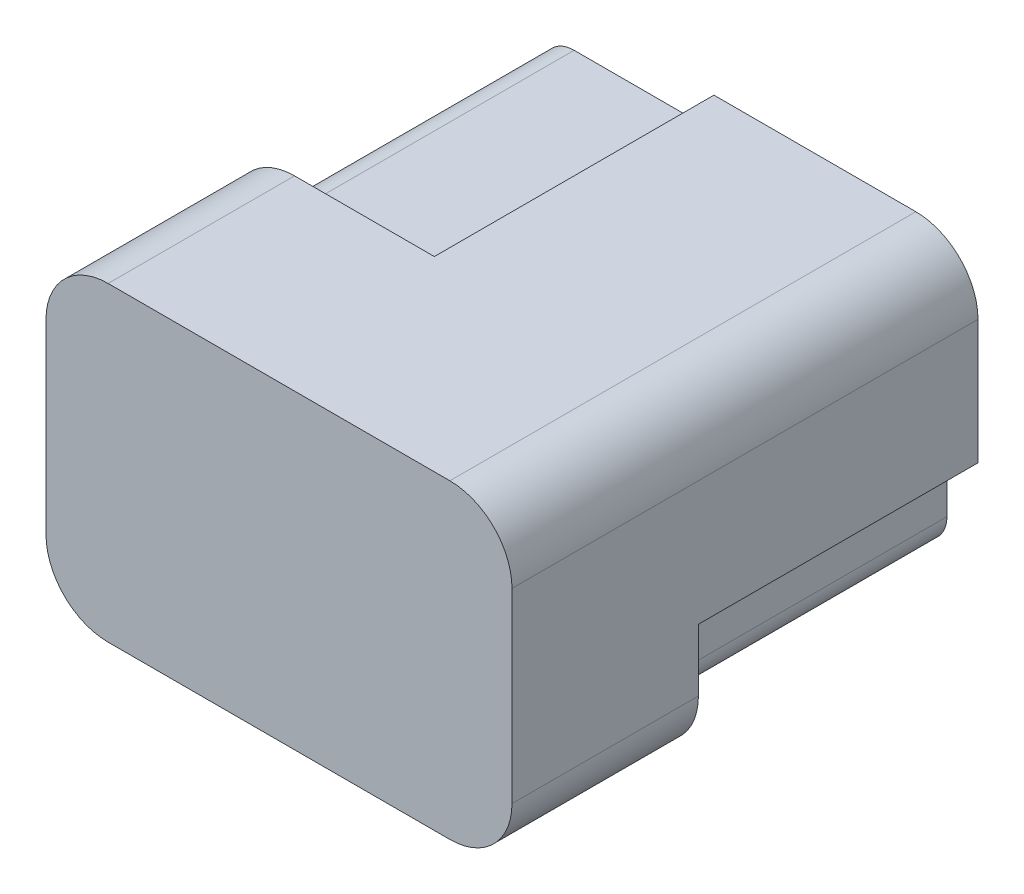
ISO-10303-21;
HEADER;
FILE_DESCRIPTION(('STEP AP214'),'2;1');
FILE_NAME('part.step','',(''),(''),'','','');
FILE_SCHEMA(('AUTOMOTIVE_DESIGN { 1 0 10303 214 1 1 1 1 }'));
ENDSEC;
DATA;
#1=APPLICATION_CONTEXT('core data for automotive mechanical design processes');
#2=APPLICATION_PROTOCOL_DEFINITION('international standard','automotive_design',2000,#1);
#3=PRODUCT_CONTEXT('',#1,'mechanical');
#4=PRODUCT('Part','Part','',(#3));
#5=PRODUCT_RELATED_PRODUCT_CATEGORY('part','',(#4));
#6=PRODUCT_DEFINITION_FORMATION('','',#4);
#7=PRODUCT_DEFINITION_CONTEXT('part definition',#1,'design');
#8=PRODUCT_DEFINITION('design','',#6,#7);
#9=PRODUCT_DEFINITION_SHAPE('','',#8);
#10=(LENGTH_UNIT() NAMED_UNIT(*) SI_UNIT(.MILLI.,.METRE.));
#11=(NAMED_UNIT(*) PLANE_ANGLE_UNIT() SI_UNIT($,.RADIAN.));
#12=(NAMED_UNIT(*) SI_UNIT($,.STERADIAN.) SOLID_ANGLE_UNIT());
#13=UNCERTAINTY_MEASURE_WITH_UNIT(LENGTH_MEASURE(1.E-05),#10,'distance_accuracy_value','');
#14=(GEOMETRIC_REPRESENTATION_CONTEXT(3) GLOBAL_UNCERTAINTY_ASSIGNED_CONTEXT((#13)) GLOBAL_UNIT_ASSIGNED_CONTEXT((#10,
#11,#12)) REPRESENTATION_CONTEXT('',''));
#15=CARTESIAN_POINT('',(0.,0.,0.));
#16=DIRECTION('',(0.,0.,1.));
#17=DIRECTION('',(1.,0.,0.));
#18=AXIS2_PLACEMENT_3D('',#15,#16,#17);
#19=CARTESIAN_POINT('',(-5.49999999999998,5.,15.));
#20=DIRECTION('',(0.,-1.,0.));
#21=DIRECTION('',(0.,0.,-1.));
#22=AXIS2_PLACEMENT_3D('',#19,#20,#21);
#23=PLANE('',#22);
#24=DIRECTION('',(0.,0.,-1.));
#25=VECTOR('',#24,1.);
#26=CARTESIAN_POINT('',(-0.999999999999999,5.,8.));
#27=LINE('',#26,#25);
#28=CARTESIAN_POINT('',(-0.999999999999999,5.,9.));
#29=VERTEX_POINT('',#28);
#30=CARTESIAN_POINT('',(-0.999999999999999,5.,0.));
#31=VERTEX_POINT('',#30);
#32=EDGE_CURVE('E201',#29,#31,#27,.T.);
#33=ORIENTED_EDGE('',*,*,#32,.F.);
#34=DIRECTION('',(1.,0.,0.));
#35=VECTOR('',#34,1.);
#36=CARTESIAN_POINT('',(-5.49999999999999,5.,9.));
#37=LINE('',#36,#35);
#38=CARTESIAN_POINT('',(-5.49999999999999,5.,9.));
#39=VERTEX_POINT('',#38);
#40=EDGE_CURVE('E37',#39,#29,#37,.T.);
#41=ORIENTED_EDGE('',*,*,#40,.F.);
#42=DIRECTION('',(0.,0.,-1.));
#43=VECTOR('',#42,1.);
#44=CARTESIAN_POINT('',(-5.49999999999998,5.,15.));
#45=LINE('',#44,#43);
#46=CARTESIAN_POINT('',(-5.49999999999998,5.,15.));
#47=VERTEX_POINT('',#46);
#48=EDGE_CURVE('E198',#47,#39,#45,.T.);
#49=ORIENTED_EDGE('',*,*,#48,.F.);
#50=DIRECTION('',(-1.,0.,0.));
#51=VECTOR('',#50,1.);
#52=CARTESIAN_POINT('',(-5.49999999999998,5.,15.));
#53=LINE('',#52,#51);
#54=CARTESIAN_POINT('',(5.5,5.,15.));
#55=VERTEX_POINT('',#54);
#56=EDGE_CURVE('E316',#55,#47,#53,.T.);
#57=ORIENTED_EDGE('',*,*,#56,.F.);
#58=DIRECTION('',(0.,0.,-1.));
#59=VECTOR('',#58,1.);
#60=CARTESIAN_POINT('',(5.5,5.,15.));
#61=LINE('',#60,#59);
#62=CARTESIAN_POINT('',(5.5,5.,0.));
#63=VERTEX_POINT('',#62);
#64=EDGE_CURVE('E204',#55,#63,#61,.T.);
#65=ORIENTED_EDGE('',*,*,#64,.T.);
#66=DIRECTION('',(-1.,0.,0.));
#67=VECTOR('',#66,1.);
#68=CARTESIAN_POINT('',(-5.49999999999998,5.,0.));
#69=LINE('',#68,#67);
#70=EDGE_CURVE('E329',#63,#31,#69,.T.);
#71=ORIENTED_EDGE('',*,*,#70,.T.);
#72=EDGE_LOOP('',(#33,#41,#49,#57,#65,#71));
#73=FACE_BOUND('',#72,.T.);
#74=ADVANCED_FACE('F33',(#73),#23,.F.);
#75=CARTESIAN_POINT('',(5.50000000000001,-3.,15.));
#76=DIRECTION('',(0.,0.,-1.));
#77=DIRECTION('',(-1.,0.,0.));
#78=AXIS2_PLACEMENT_3D('',#75,#76,#77);
#79=CYLINDRICAL_SURFACE('',#78,2.);
#80=DIRECTION('',(0.,0.,-1.));
#81=VECTOR('',#80,1.);
#82=CARTESIAN_POINT('',(5.5,-5.,15.));
#83=LINE('',#82,#81);
#84=CARTESIAN_POINT('',(5.5,-5.,15.));
#85=VERTEX_POINT('',#84);
#86=CARTESIAN_POINT('',(5.5,-5.,9.));
#87=VERTEX_POINT('',#86);
#88=EDGE_CURVE('E325',#85,#87,#83,.T.);
#89=ORIENTED_EDGE('',*,*,#88,.T.);
#90=CARTESIAN_POINT('',(5.50000000000001,-3.,9.));
#91=DIRECTION('',(0.,0.,-1.));
#92=DIRECTION('',(-1.,0.,0.));
#93=AXIS2_PLACEMENT_3D('',#90,#91,#92);
#94=CIRCLE('',#93,2.);
#95=CARTESIAN_POINT('',(7.50000000000001,-2.99999999999998,9.));
#96=VERTEX_POINT('',#95);
#97=EDGE_CURVE('E230',#87,#96,#94,.F.);
#98=ORIENTED_EDGE('',*,*,#97,.T.);
#99=DIRECTION('',(0.,0.,-1.));
#100=VECTOR('',#99,1.);
#101=CARTESIAN_POINT('',(7.50000000000001,-2.99999999999998,15.));
#102=LINE('',#101,#100);
#103=CARTESIAN_POINT('',(7.50000000000001,-2.99999999999998,15.));
#104=VERTEX_POINT('',#103);
#105=EDGE_CURVE('E224',#104,#96,#102,.T.);
#106=ORIENTED_EDGE('',*,*,#105,.F.);
#107=CARTESIAN_POINT('',(5.50000000000001,-3.,15.));
#108=DIRECTION('',(0.,0.,1.));
#109=DIRECTION('',(1.,0.,0.));
#110=AXIS2_PLACEMENT_3D('',#107,#108,#109);
#111=CIRCLE('',#110,2.);
#112=EDGE_CURVE('E308',#85,#104,#111,.T.);
#113=ORIENTED_EDGE('',*,*,#112,.F.);
#114=EDGE_LOOP('',(#89,#98,#106,#113));
#115=FACE_BOUND('',#114,.T.);
#116=ADVANCED_FACE('F391',(#115),#79,.T.);
#117=CARTESIAN_POINT('',(-5.49999999999999,3.,15.));
#118=DIRECTION('',(0.,0.,-1.));
#119=DIRECTION('',(-1.,0.,0.));
#120=AXIS2_PLACEMENT_3D('',#117,#118,#119);
#121=CYLINDRICAL_SURFACE('',#120,2.);
#122=ORIENTED_EDGE('',*,*,#48,.T.);
#123=CARTESIAN_POINT('',(-5.49999999999999,3.,9.));
#124=DIRECTION('',(0.,0.,1.));
#125=DIRECTION('',(1.,0.,0.));
#126=AXIS2_PLACEMENT_3D('',#123,#124,#125);
#127=CIRCLE('',#126,2.);
#128=CARTESIAN_POINT('',(-7.49999999999999,3.,9.));
#129=VERTEX_POINT('',#128);
#130=EDGE_CURVE('E172',#39,#129,#127,.T.);
#131=ORIENTED_EDGE('',*,*,#130,.T.);
#132=DIRECTION('',(0.,0.,-1.));
#133=VECTOR('',#132,1.);
#134=CARTESIAN_POINT('',(-7.49999999999999,2.99999999999999,15.));
#135=LINE('',#134,#133);
#136=CARTESIAN_POINT('',(-7.49999999999999,2.99999999999999,15.));
#137=VERTEX_POINT('',#136);
#138=EDGE_CURVE('E205',#137,#129,#135,.T.);
#139=ORIENTED_EDGE('',*,*,#138,.F.);
#140=CARTESIAN_POINT('',(-5.49999999999999,3.,15.));
#141=DIRECTION('',(0.,0.,1.));
#142=DIRECTION('',(-1.,0.,0.));
#143=AXIS2_PLACEMENT_3D('',#140,#141,#142);
#144=CIRCLE('',#143,2.);
#145=EDGE_CURVE('E203',#47,#137,#144,.T.);
#146=ORIENTED_EDGE('',*,*,#145,.F.);
#147=EDGE_LOOP('',(#122,#131,#139,#146));
#148=FACE_BOUND('',#147,.T.);
#149=ADVANCED_FACE('F202',(#148),#121,.T.);
#150=CARTESIAN_POINT('',(7.50000000000001,-2.99999999999998,15.));
#151=DIRECTION('',(-1.,0.,0.));
#152=DIRECTION('',(0.,0.,1.));
#153=AXIS2_PLACEMENT_3D('',#150,#151,#152);
#154=PLANE('',#153);
#155=ORIENTED_EDGE('',*,*,#105,.T.);
#156=DIRECTION('',(0.,1.,0.));
#157=VECTOR('',#156,1.);
#158=CARTESIAN_POINT('',(7.50000000000001,-1.,9.));
#159=LINE('',#158,#157);
#160=CARTESIAN_POINT('',(7.50000000000001,-1.,9.));
#161=VERTEX_POINT('',#160);
#162=EDGE_CURVE('E227',#96,#161,#159,.T.);
#163=ORIENTED_EDGE('',*,*,#162,.T.);
#164=DIRECTION('',(0.,0.,-1.));
#165=VECTOR('',#164,1.);
#166=CARTESIAN_POINT('',(7.50000000000001,-1.,8.));
#167=LINE('',#166,#165);
#168=CARTESIAN_POINT('',(7.50000000000001,-1.,0.));
#169=VERTEX_POINT('',#168);
#170=EDGE_CURVE('E269',#161,#169,#167,.T.);
#171=ORIENTED_EDGE('',*,*,#170,.T.);
#172=DIRECTION('',(0.,1.,0.));
#173=VECTOR('',#172,1.);
#174=CARTESIAN_POINT('',(7.50000000000001,-2.99999999999998,0.));
#175=LINE('',#174,#173);
#176=CARTESIAN_POINT('',(7.50000000000001,2.99999999999999,0.));
#177=VERTEX_POINT('',#176);
#178=EDGE_CURVE('E298',#169,#177,#175,.T.);
#179=ORIENTED_EDGE('',*,*,#178,.T.);
#180=DIRECTION('',(0.,0.,-1.));
#181=VECTOR('',#180,1.);
#182=CARTESIAN_POINT('',(7.50000000000001,2.99999999999999,15.));
#183=LINE('',#182,#181);
#184=CARTESIAN_POINT('',(7.50000000000001,2.99999999999999,15.));
#185=VERTEX_POINT('',#184);
#186=EDGE_CURVE('E208',#185,#177,#183,.T.);
#187=ORIENTED_EDGE('',*,*,#186,.F.);
#188=DIRECTION('',(0.,1.,0.));
#189=VECTOR('',#188,1.);
#190=CARTESIAN_POINT('',(7.50000000000001,-2.99999999999998,15.));
#191=LINE('',#190,#189);
#192=EDGE_CURVE('E311',#104,#185,#191,.T.);
#193=ORIENTED_EDGE('',*,*,#192,.F.);
#194=EDGE_LOOP('',(#155,#163,#171,#179,#187,#193));
#195=FACE_BOUND('',#194,.T.);
#196=ADVANCED_FACE('F387',(#195),#154,.F.);
#197=CARTESIAN_POINT('',(5.50000000000001,3.,15.));
#198=DIRECTION('',(0.,0.,-1.));
#199=DIRECTION('',(-1.,0.,0.));
#200=AXIS2_PLACEMENT_3D('',#197,#198,#199);
#201=CYLINDRICAL_SURFACE('',#200,2.);
#202=CARTESIAN_POINT('',(5.50000000000001,3.,0.));
#203=DIRECTION('',(0.,0.,1.));
#204=DIRECTION('',(-1.,0.,0.));
#205=AXIS2_PLACEMENT_3D('',#202,#203,#204);
#206=CIRCLE('',#205,2.);
#207=EDGE_CURVE('E327',#177,#63,#206,.T.);
#208=ORIENTED_EDGE('',*,*,#207,.T.);
#209=ORIENTED_EDGE('',*,*,#64,.F.);
#210=CARTESIAN_POINT('',(5.50000000000001,3.,15.));
#211=DIRECTION('',(0.,0.,1.));
#212=DIRECTION('',(-1.,0.,0.));
#213=AXIS2_PLACEMENT_3D('',#210,#211,#212);
#214=CIRCLE('',#213,2.);
#215=EDGE_CURVE('E314',#185,#55,#214,.T.);
#216=ORIENTED_EDGE('',*,*,#215,.F.);
#217=ORIENTED_EDGE('',*,*,#186,.T.);
#218=EDGE_LOOP('',(#208,#209,#216,#217));
#219=FACE_BOUND('',#218,.T.);
#220=ADVANCED_FACE('F455',(#219),#201,.T.);
#221=CARTESIAN_POINT('',(-7.49999999999999,-2.99999999999998,15.));
#222=DIRECTION('',(1.,0.,0.));
#223=DIRECTION('',(0.,0.,-1.));
#224=AXIS2_PLACEMENT_3D('',#221,#222,#223);
#225=PLANE('',#224);
#226=DIRECTION('',(0.,-1.,0.));
#227=VECTOR('',#226,1.);
#228=CARTESIAN_POINT('',(-7.49999999999999,3.,9.));
#229=LINE('',#228,#227);
#230=CARTESIAN_POINT('',(-7.49999999999999,2.,9.));
#231=VERTEX_POINT('',#230);
#232=EDGE_CURVE('E216',#129,#231,#229,.T.);
#233=ORIENTED_EDGE('',*,*,#232,.T.);
#234=DIRECTION('',(0.,0.,-1.));
#235=VECTOR('',#234,1.);
#236=CARTESIAN_POINT('',(-7.49999999999999,2.,8.));
#237=LINE('',#236,#235);
#238=CARTESIAN_POINT('',(-7.49999999999999,2.,0.));
#239=VERTEX_POINT('',#238);
#240=EDGE_CURVE('E295',#231,#239,#237,.T.);
#241=ORIENTED_EDGE('',*,*,#240,.T.);
#242=DIRECTION('',(0.,-1.,0.));
#243=VECTOR('',#242,1.);
#244=CARTESIAN_POINT('',(-7.49999999999999,-2.99999999999998,0.));
#245=LINE('',#244,#243);
#246=CARTESIAN_POINT('',(-7.49999999999999,-2.99999999999998,0.));
#247=VERTEX_POINT('',#246);
#248=EDGE_CURVE('E331',#239,#247,#245,.T.);
#249=ORIENTED_EDGE('',*,*,#248,.T.);
#250=DIRECTION('',(0.,0.,-1.));
#251=VECTOR('',#250,1.);
#252=CARTESIAN_POINT('',(-7.49999999999999,-2.99999999999998,15.));
#253=LINE('',#252,#251);
#254=CARTESIAN_POINT('',(-7.49999999999999,-2.99999999999998,15.));
#255=VERTEX_POINT('',#254);
#256=EDGE_CURVE('E210',#255,#247,#253,.T.);
#257=ORIENTED_EDGE('',*,*,#256,.F.);
#258=DIRECTION('',(0.,-1.,0.));
#259=VECTOR('',#258,1.);
#260=CARTESIAN_POINT('',(-7.49999999999999,-2.99999999999998,15.));
#261=LINE('',#260,#259);
#262=EDGE_CURVE('E319',#137,#255,#261,.T.);
#263=ORIENTED_EDGE('',*,*,#262,.F.);
#264=ORIENTED_EDGE('',*,*,#138,.T.);
#265=EDGE_LOOP('',(#233,#241,#249,#257,#263,#264));
#266=FACE_BOUND('',#265,.T.);
#267=ADVANCED_FACE('F362',(#266),#225,.F.);
#268=CARTESIAN_POINT('',(-5.49999999999999,-3.,15.));
#269=DIRECTION('',(0.,0.,-1.));
#270=DIRECTION('',(-1.,0.,0.));
#271=AXIS2_PLACEMENT_3D('',#268,#269,#270);
#272=CYLINDRICAL_SURFACE('',#271,2.);
#273=CARTESIAN_POINT('',(-5.49999999999999,-3.,0.));
#274=DIRECTION('',(0.,0.,1.));
#275=DIRECTION('',(-1.,0.,0.));
#276=AXIS2_PLACEMENT_3D('',#273,#274,#275);
#277=CIRCLE('',#276,2.);
#278=CARTESIAN_POINT('',(-5.49999999999998,-5.,0.));
#279=VERTEX_POINT('',#278);
#280=EDGE_CURVE('E333',#247,#279,#277,.T.);
#281=ORIENTED_EDGE('',*,*,#280,.T.);
#282=DIRECTION('',(0.,0.,-1.));
#283=VECTOR('',#282,1.);
#284=CARTESIAN_POINT('',(-5.49999999999998,-5.,15.));
#285=LINE('',#284,#283);
#286=CARTESIAN_POINT('',(-5.49999999999998,-5.,15.));
#287=VERTEX_POINT('',#286);
#288=EDGE_CURVE('E337',#287,#279,#285,.T.);
#289=ORIENTED_EDGE('',*,*,#288,.F.);
#290=CARTESIAN_POINT('',(-5.49999999999999,-3.,15.));
#291=DIRECTION('',(0.,0.,1.));
#292=DIRECTION('',(-1.,0.,0.));
#293=AXIS2_PLACEMENT_3D('',#290,#291,#292);
#294=CIRCLE('',#293,2.);
#295=EDGE_CURVE('E321',#255,#287,#294,.T.);
#296=ORIENTED_EDGE('',*,*,#295,.F.);
#297=ORIENTED_EDGE('',*,*,#256,.T.);
#298=EDGE_LOOP('',(#281,#289,#296,#297));
#299=FACE_BOUND('',#298,.T.);
#300=ADVANCED_FACE('F344',(#299),#272,.T.);
#301=CARTESIAN_POINT('',(-5.49999999999998,-5.,15.));
#302=DIRECTION('',(0.,1.,0.));
#303=DIRECTION('',(0.,0.,1.));
#304=AXIS2_PLACEMENT_3D('',#301,#302,#303);
#305=PLANE('',#304);
#306=DIRECTION('',(0.,0.,-1.));
#307=VECTOR('',#306,1.);
#308=CARTESIAN_POINT('',(0.999999999999999,-5.,8.));
#309=LINE('',#308,#307);
#310=CARTESIAN_POINT('',(0.999999999999999,-5.,9.));
#311=VERTEX_POINT('',#310);
#312=CARTESIAN_POINT('',(0.999999999999999,-5.,0.));
#313=VERTEX_POINT('',#312);
#314=EDGE_CURVE('E51',#311,#313,#309,.T.);
#315=ORIENTED_EDGE('',*,*,#314,.F.);
#316=DIRECTION('',(1.,0.,0.));
#317=VECTOR('',#316,1.);
#318=CARTESIAN_POINT('',(5.5,-5.,9.));
#319=LINE('',#318,#317);
#320=EDGE_CURVE('E55',#311,#87,#319,.T.);
#321=ORIENTED_EDGE('',*,*,#320,.T.);
#322=ORIENTED_EDGE('',*,*,#88,.F.);
#323=DIRECTION('',(1.,0.,0.));
#324=VECTOR('',#323,1.);
#325=CARTESIAN_POINT('',(-5.49999999999998,-5.,15.));
#326=LINE('',#325,#324);
#327=EDGE_CURVE('E323',#287,#85,#326,.T.);
#328=ORIENTED_EDGE('',*,*,#327,.F.);
#329=ORIENTED_EDGE('',*,*,#288,.T.);
#330=DIRECTION('',(1.,0.,0.));
#331=VECTOR('',#330,1.);
#332=CARTESIAN_POINT('',(-5.49999999999998,-5.,0.));
#333=LINE('',#332,#331);
#334=EDGE_CURVE('E312',#279,#313,#333,.T.);
#335=ORIENTED_EDGE('',*,*,#334,.T.);
#336=EDGE_LOOP('',(#315,#321,#322,#328,#329,#335));
#337=FACE_BOUND('',#336,.T.);
#338=ADVANCED_FACE('F355',(#337),#305,.F.);
#339=CARTESIAN_POINT('',(5.50000000000001,-3.,15.));
#340=DIRECTION('',(0.,0.,1.));
#341=DIRECTION('',(1.,0.,0.));
#342=AXIS2_PLACEMENT_3D('',#339,#340,#341);
#343=PLANE('',#342);
#344=ORIENTED_EDGE('',*,*,#112,.T.);
#345=ORIENTED_EDGE('',*,*,#192,.T.);
#346=ORIENTED_EDGE('',*,*,#215,.T.);
#347=ORIENTED_EDGE('',*,*,#56,.T.);
#348=ORIENTED_EDGE('',*,*,#145,.T.);
#349=ORIENTED_EDGE('',*,*,#262,.T.);
#350=ORIENTED_EDGE('',*,*,#295,.T.);
#351=ORIENTED_EDGE('',*,*,#327,.T.);
#352=EDGE_LOOP('',(#344,#345,#346,#347,#348,#349,#350,#351));
#353=FACE_BOUND('',#352,.T.);
#354=ADVANCED_FACE('F359',(#353),#343,.T.);
#355=CARTESIAN_POINT('',(5.50000000000001,-3.,0.));
#356=DIRECTION('',(0.,0.,1.));
#357=DIRECTION('',(1.,0.,0.));
#358=AXIS2_PLACEMENT_3D('',#355,#356,#357);
#359=PLANE('',#358);
#360=DIRECTION('',(1.,0.,0.));
#361=VECTOR('',#360,1.);
#362=CARTESIAN_POINT('',(5.50000000000001,-4.,0.));
#363=LINE('',#362,#361);
#364=CARTESIAN_POINT('',(1.,-4.,0.));
#365=VERTEX_POINT('',#364);
#366=CARTESIAN_POINT('',(5.50000000000001,-4.,0.));
#367=VERTEX_POINT('',#366);
#368=EDGE_CURVE('E259',#365,#367,#363,.T.);
#369=ORIENTED_EDGE('',*,*,#368,.F.);
#370=DIRECTION('',(0.,1.,0.));
#371=VECTOR('',#370,1.);
#372=CARTESIAN_POINT('',(1.,-4.,0.));
#373=LINE('',#372,#371);
#374=EDGE_CURVE('E256',#313,#365,#373,.T.);
#375=ORIENTED_EDGE('',*,*,#374,.F.);
#376=ORIENTED_EDGE('',*,*,#334,.F.);
#377=ORIENTED_EDGE('',*,*,#280,.F.);
#378=ORIENTED_EDGE('',*,*,#248,.F.);
#379=DIRECTION('',(-1.,0.,0.));
#380=VECTOR('',#379,1.);
#381=CARTESIAN_POINT('',(-6.49999999999999,2.,0.));
#382=LINE('',#381,#380);
#383=CARTESIAN_POINT('',(-6.49999999999999,2.,0.));
#384=VERTEX_POINT('',#383);
#385=EDGE_CURVE('E278',#384,#239,#382,.T.);
#386=ORIENTED_EDGE('',*,*,#385,.F.);
#387=DIRECTION('',(0.,-1.,0.));
#388=VECTOR('',#387,1.);
#389=CARTESIAN_POINT('',(-6.49999999999999,3.,0.));
#390=LINE('',#389,#388);
#391=CARTESIAN_POINT('',(-6.49999999999999,3.,0.));
#392=VERTEX_POINT('',#391);
#393=EDGE_CURVE('E291',#392,#384,#390,.T.);
#394=ORIENTED_EDGE('',*,*,#393,.F.);
#395=CARTESIAN_POINT('',(-5.49999999999999,3.,0.));
#396=DIRECTION('',(0.,0.,1.));
#397=DIRECTION('',(1.,0.,0.));
#398=AXIS2_PLACEMENT_3D('',#395,#396,#397);
#399=CIRCLE('',#398,1.);
#400=CARTESIAN_POINT('',(-5.49999999999999,4.,0.));
#401=VERTEX_POINT('',#400);
#402=EDGE_CURVE('E288',#401,#392,#399,.T.);
#403=ORIENTED_EDGE('',*,*,#402,.F.);
#404=DIRECTION('',(-1.,0.,0.));
#405=VECTOR('',#404,1.);
#406=CARTESIAN_POINT('',(-1.,4.,0.));
#407=LINE('',#406,#405);
#408=CARTESIAN_POINT('',(-1.,4.,0.));
#409=VERTEX_POINT('',#408);
#410=EDGE_CURVE('E285',#409,#401,#407,.T.);
#411=ORIENTED_EDGE('',*,*,#410,.F.);
#412=DIRECTION('',(0.,-1.,0.));
#413=VECTOR('',#412,1.);
#414=CARTESIAN_POINT('',(-0.999999999999999,5.,0.));
#415=LINE('',#414,#413);
#416=EDGE_CURVE('E265',#31,#409,#415,.T.);
#417=ORIENTED_EDGE('',*,*,#416,.F.);
#418=ORIENTED_EDGE('',*,*,#70,.F.);
#419=ORIENTED_EDGE('',*,*,#207,.F.);
#420=ORIENTED_EDGE('',*,*,#178,.F.);
#421=DIRECTION('',(1.,0.,0.));
#422=VECTOR('',#421,1.);
#423=CARTESIAN_POINT('',(7.50000000000001,-1.,0.));
#424=LINE('',#423,#422);
#425=CARTESIAN_POINT('',(6.50000000000001,-1.,0.));
#426=VERTEX_POINT('',#425);
#427=EDGE_CURVE('E249',#426,#169,#424,.T.);
#428=ORIENTED_EDGE('',*,*,#427,.F.);
#429=DIRECTION('',(0.,1.,0.));
#430=VECTOR('',#429,1.);
#431=CARTESIAN_POINT('',(6.50000000000001,-1.,0.));
#432=LINE('',#431,#430);
#433=CARTESIAN_POINT('',(6.50000000000001,-3.,0.));
#434=VERTEX_POINT('',#433);
#435=EDGE_CURVE('E242',#434,#426,#432,.T.);
#436=ORIENTED_EDGE('',*,*,#435,.F.);
#437=CARTESIAN_POINT('',(5.50000000000001,-3.,0.));
#438=DIRECTION('',(0.,0.,1.));
#439=DIRECTION('',(-1.,0.,0.));
#440=AXIS2_PLACEMENT_3D('',#437,#438,#439);
#441=CIRCLE('',#440,1.);
#442=EDGE_CURVE('E237',#367,#434,#441,.T.);
#443=ORIENTED_EDGE('',*,*,#442,.F.);
#444=EDGE_LOOP('',(#369,#375,#376,#377,#378,#386,#394,#403,#411,#417,#418,#419,#420,#428,#436,#443));
#445=FACE_BOUND('',#444,.T.);
#446=ADVANCED_FACE('F352',(#445),#359,.F.);
#447=CARTESIAN_POINT('',(-6.49999999999999,2.,8.));
#448=DIRECTION('',(0.,-1.,0.));
#449=DIRECTION('',(0.,0.,-1.));
#450=AXIS2_PLACEMENT_3D('',#447,#448,#449);
#451=PLANE('',#450);
#452=ORIENTED_EDGE('',*,*,#385,.T.);
#453=ORIENTED_EDGE('',*,*,#240,.F.);
#454=DIRECTION('',(-0.707106781186547,0.,0.707106781186548));
#455=VECTOR('',#454,1.);
#456=CARTESIAN_POINT('',(-7.49999999999999,2.,9.));
#457=LINE('',#456,#455);
#458=CARTESIAN_POINT('',(-6.49999999999999,2.,8.));
#459=VERTEX_POINT('',#458);
#460=EDGE_CURVE('E183',#459,#231,#457,.T.);
#461=ORIENTED_EDGE('',*,*,#460,.F.);
#462=DIRECTION('',(0.,0.,-1.));
#463=VECTOR('',#462,1.);
#464=CARTESIAN_POINT('',(-6.49999999999999,2.,8.));
#465=LINE('',#464,#463);
#466=EDGE_CURVE('E299',#459,#384,#465,.T.);
#467=ORIENTED_EDGE('',*,*,#466,.T.);
#468=EDGE_LOOP('',(#452,#453,#461,#467));
#469=FACE_BOUND('',#468,.T.);
#470=ADVANCED_FACE('F427',(#469),#451,.F.);
#471=CARTESIAN_POINT('',(-6.49999999999999,3.,8.));
#472=DIRECTION('',(1.,0.,0.));
#473=DIRECTION('',(0.,1.,0.));
#474=AXIS2_PLACEMENT_3D('',#471,#472,#473);
#475=PLANE('',#474);
#476=ORIENTED_EDGE('',*,*,#393,.T.);
#477=ORIENTED_EDGE('',*,*,#466,.F.);
#478=DIRECTION('',(0.,-1.,0.));
#479=VECTOR('',#478,1.);
#480=CARTESIAN_POINT('',(-6.49999999999999,3.,8.));
#481=LINE('',#480,#479);
#482=CARTESIAN_POINT('',(-6.49999999999999,3.,8.));
#483=VERTEX_POINT('',#482);
#484=EDGE_CURVE('E280',#483,#459,#481,.T.);
#485=ORIENTED_EDGE('',*,*,#484,.F.);
#486=DIRECTION('',(0.,0.,-1.));
#487=VECTOR('',#486,1.);
#488=CARTESIAN_POINT('',(-6.49999999999999,3.,8.));
#489=LINE('',#488,#487);
#490=EDGE_CURVE('E301',#483,#392,#489,.T.);
#491=ORIENTED_EDGE('',*,*,#490,.T.);
#492=EDGE_LOOP('',(#476,#477,#485,#491));
#493=FACE_BOUND('',#492,.T.);
#494=ADVANCED_FACE('F430',(#493),#475,.F.);
#495=CARTESIAN_POINT('',(-5.49999999999999,3.,8.));
#496=DIRECTION('',(0.,0.,-1.));
#497=DIRECTION('',(-1.,0.,0.));
#498=AXIS2_PLACEMENT_3D('',#495,#496,#497);
#499=CYLINDRICAL_SURFACE('',#498,1.);
#500=ORIENTED_EDGE('',*,*,#402,.T.);
#501=ORIENTED_EDGE('',*,*,#490,.F.);
#502=CARTESIAN_POINT('',(-5.49999999999999,3.,8.));
#503=DIRECTION('',(0.,0.,1.));
#504=DIRECTION('',(1.,0.,0.));
#505=AXIS2_PLACEMENT_3D('',#502,#503,#504);
#506=CIRCLE('',#505,1.);
#507=CARTESIAN_POINT('',(-5.49999999999999,4.,8.));
#508=VERTEX_POINT('',#507);
#509=EDGE_CURVE('E277',#508,#483,#506,.T.);
#510=ORIENTED_EDGE('',*,*,#509,.F.);
#511=DIRECTION('',(0.,0.,-1.));
#512=VECTOR('',#511,1.);
#513=CARTESIAN_POINT('',(-5.49999999999999,4.,8.));
#514=LINE('',#513,#512);
#515=EDGE_CURVE('E303',#508,#401,#514,.T.);
#516=ORIENTED_EDGE('',*,*,#515,.T.);
#517=EDGE_LOOP('',(#500,#501,#510,#516));
#518=FACE_BOUND('',#517,.T.);
#519=ADVANCED_FACE('F434',(#518),#499,.T.);
#520=CARTESIAN_POINT('',(-1.,4.,8.));
#521=DIRECTION('',(0.,-1.,0.));
#522=DIRECTION('',(0.,0.,-1.));
#523=AXIS2_PLACEMENT_3D('',#520,#521,#522);
#524=PLANE('',#523);
#525=ORIENTED_EDGE('',*,*,#410,.T.);
#526=ORIENTED_EDGE('',*,*,#515,.F.);
#527=DIRECTION('',(-1.,0.,0.));
#528=VECTOR('',#527,1.);
#529=CARTESIAN_POINT('',(-1.,4.,8.));
#530=LINE('',#529,#528);
#531=CARTESIAN_POINT('',(-1.,4.,8.));
#532=VERTEX_POINT('',#531);
#533=EDGE_CURVE('E191',#532,#508,#530,.T.);
#534=ORIENTED_EDGE('',*,*,#533,.F.);
#535=DIRECTION('',(0.,0.,-1.));
#536=VECTOR('',#535,1.);
#537=CARTESIAN_POINT('',(-1.,4.,8.));
#538=LINE('',#537,#536);
#539=EDGE_CURVE('E305',#532,#409,#538,.T.);
#540=ORIENTED_EDGE('',*,*,#539,.T.);
#541=EDGE_LOOP('',(#525,#526,#534,#540));
#542=FACE_BOUND('',#541,.T.);
#543=ADVANCED_FACE('F438',(#542),#524,.F.);
#544=CARTESIAN_POINT('',(-0.999999999999999,5.,8.));
#545=DIRECTION('',(1.,0.,0.));
#546=DIRECTION('',(0.,1.,0.));
#547=AXIS2_PLACEMENT_3D('',#544,#545,#546);
#548=PLANE('',#547);
#549=ORIENTED_EDGE('',*,*,#416,.T.);
#550=ORIENTED_EDGE('',*,*,#539,.F.);
#551=DIRECTION('',(0.,0.707106781186547,0.707106781186548));
#552=VECTOR('',#551,1.);
#553=CARTESIAN_POINT('',(-0.999999999999999,5.,9.));
#554=LINE('',#553,#552);
#555=EDGE_CURVE('E193',#532,#29,#554,.T.);
#556=ORIENTED_EDGE('',*,*,#555,.T.);
#557=ORIENTED_EDGE('',*,*,#32,.T.);
#558=EDGE_LOOP('',(#549,#550,#556,#557));
#559=FACE_BOUND('',#558,.T.);
#560=ADVANCED_FACE('F426',(#559),#548,.F.);
#561=CARTESIAN_POINT('',(5.50000000000001,-3.,8.));
#562=DIRECTION('',(0.,0.,-1.));
#563=DIRECTION('',(-1.,0.,0.));
#564=AXIS2_PLACEMENT_3D('',#561,#562,#563);
#565=CYLINDRICAL_SURFACE('',#564,1.);
#566=ORIENTED_EDGE('',*,*,#442,.T.);
#567=DIRECTION('',(0.,0.,-1.));
#568=VECTOR('',#567,1.);
#569=CARTESIAN_POINT('',(6.50000000000001,-3.,8.));
#570=LINE('',#569,#568);
#571=CARTESIAN_POINT('',(6.50000000000001,-3.,8.));
#572=VERTEX_POINT('',#571);
#573=EDGE_CURVE('E274',#572,#434,#570,.T.);
#574=ORIENTED_EDGE('',*,*,#573,.F.);
#575=CARTESIAN_POINT('',(5.50000000000001,-3.,8.));
#576=DIRECTION('',(0.,0.,1.));
#577=DIRECTION('',(-1.,0.,0.));
#578=AXIS2_PLACEMENT_3D('',#575,#576,#577);
#579=CIRCLE('',#578,1.);
#580=CARTESIAN_POINT('',(5.50000000000001,-4.,8.));
#581=VERTEX_POINT('',#580);
#582=EDGE_CURVE('E262',#581,#572,#579,.T.);
#583=ORIENTED_EDGE('',*,*,#582,.F.);
#584=DIRECTION('',(0.,0.,-1.));
#585=VECTOR('',#584,1.);
#586=CARTESIAN_POINT('',(5.50000000000001,-4.,8.));
#587=LINE('',#586,#585);
#588=EDGE_CURVE('E263',#581,#367,#587,.T.);
#589=ORIENTED_EDGE('',*,*,#588,.T.);
#590=EDGE_LOOP('',(#566,#574,#583,#589));
#591=FACE_BOUND('',#590,.T.);
#592=ADVANCED_FACE('F381',(#591),#565,.T.);
#593=CARTESIAN_POINT('',(5.50000000000001,-4.,8.));
#594=DIRECTION('',(0.,1.,0.));
#595=DIRECTION('',(0.,0.,1.));
#596=AXIS2_PLACEMENT_3D('',#593,#594,#595);
#597=PLANE('',#596);
#598=ORIENTED_EDGE('',*,*,#368,.T.);
#599=ORIENTED_EDGE('',*,*,#588,.F.);
#600=DIRECTION('',(1.,0.,0.));
#601=VECTOR('',#600,1.);
#602=CARTESIAN_POINT('',(5.50000000000001,-4.,8.));
#603=LINE('',#602,#601);
#604=CARTESIAN_POINT('',(1.,-4.,8.));
#605=VERTEX_POINT('',#604);
#606=EDGE_CURVE('E252',#605,#581,#603,.T.);
#607=ORIENTED_EDGE('',*,*,#606,.F.);
#608=DIRECTION('',(0.,0.,-1.));
#609=VECTOR('',#608,1.);
#610=CARTESIAN_POINT('',(1.,-4.,8.));
#611=LINE('',#610,#609);
#612=EDGE_CURVE('E266',#605,#365,#611,.T.);
#613=ORIENTED_EDGE('',*,*,#612,.T.);
#614=EDGE_LOOP('',(#598,#599,#607,#613));
#615=FACE_BOUND('',#614,.T.);
#616=ADVANCED_FACE('F379',(#615),#597,.F.);
#617=CARTESIAN_POINT('',(1.,-4.,8.));
#618=DIRECTION('',(-1.,0.,0.));
#619=DIRECTION('',(0.,-1.,0.));
#620=AXIS2_PLACEMENT_3D('',#617,#618,#619);
#621=PLANE('',#620);
#622=ORIENTED_EDGE('',*,*,#374,.T.);
#623=ORIENTED_EDGE('',*,*,#612,.F.);
#624=DIRECTION('',(0.,-0.707106781186546,0.707106781186549));
#625=VECTOR('',#624,1.);
#626=CARTESIAN_POINT('',(1.,-4.,8.));
#627=LINE('',#626,#625);
#628=EDGE_CURVE('E11',#605,#311,#627,.T.);
#629=ORIENTED_EDGE('',*,*,#628,.T.);
#630=ORIENTED_EDGE('',*,*,#314,.T.);
#631=EDGE_LOOP('',(#622,#623,#629,#630));
#632=FACE_BOUND('',#631,.T.);
#633=ADVANCED_FACE('F419',(#632),#621,.F.);
#634=CARTESIAN_POINT('',(7.50000000000001,-1.,8.));
#635=DIRECTION('',(0.,1.,0.));
#636=DIRECTION('',(-1.,0.,0.));
#637=AXIS2_PLACEMENT_3D('',#634,#635,#636);
#638=PLANE('',#637);
#639=ORIENTED_EDGE('',*,*,#427,.T.);
#640=ORIENTED_EDGE('',*,*,#170,.F.);
#641=DIRECTION('',(-0.707106781186546,0.,-0.707106781186549));
#642=VECTOR('',#641,1.);
#643=CARTESIAN_POINT('',(7.00000000000001,-1.,8.5));
#644=LINE('',#643,#642);
#645=CARTESIAN_POINT('',(6.50000000000001,-1.,8.));
#646=VERTEX_POINT('',#645);
#647=EDGE_CURVE('E43',#161,#646,#644,.T.);
#648=ORIENTED_EDGE('',*,*,#647,.T.);
#649=DIRECTION('',(0.,0.,-1.));
#650=VECTOR('',#649,1.);
#651=CARTESIAN_POINT('',(6.50000000000001,-1.,8.));
#652=LINE('',#651,#650);
#653=EDGE_CURVE('E272',#646,#426,#652,.T.);
#654=ORIENTED_EDGE('',*,*,#653,.T.);
#655=EDGE_LOOP('',(#639,#640,#648,#654));
#656=FACE_BOUND('',#655,.T.);
#657=ADVANCED_FACE('F413',(#656),#638,.F.);
#658=CARTESIAN_POINT('',(6.50000000000001,-1.,8.));
#659=DIRECTION('',(-1.,0.,0.));
#660=DIRECTION('',(0.,-1.,0.));
#661=AXIS2_PLACEMENT_3D('',#658,#659,#660);
#662=PLANE('',#661);
#663=ORIENTED_EDGE('',*,*,#435,.T.);
#664=ORIENTED_EDGE('',*,*,#653,.F.);
#665=DIRECTION('',(0.,1.,0.));
#666=VECTOR('',#665,1.);
#667=CARTESIAN_POINT('',(6.50000000000001,-1.,8.));
#668=LINE('',#667,#666);
#669=EDGE_CURVE('E369',#572,#646,#668,.T.);
#670=ORIENTED_EDGE('',*,*,#669,.F.);
#671=ORIENTED_EDGE('',*,*,#573,.T.);
#672=EDGE_LOOP('',(#663,#664,#670,#671));
#673=FACE_BOUND('',#672,.T.);
#674=ADVANCED_FACE('F409',(#673),#662,.F.);
#675=CARTESIAN_POINT('',(5.50000000000001,-4.,8.));
#676=DIRECTION('',(0.,-0.707106781186549,-0.707106781186546));
#677=DIRECTION('',(1.,0.,0.));
#678=AXIS2_PLACEMENT_3D('',#675,#676,#677);
#679=PLANE('',#678);
#680=ORIENTED_EDGE('',*,*,#628,.F.);
#681=ORIENTED_EDGE('',*,*,#606,.T.);
#682=DIRECTION('',(0.,0.707106781186546,-0.707106781186549));
#683=VECTOR('',#682,1.);
#684=CARTESIAN_POINT('',(5.5,-5.,9.));
#685=LINE('',#684,#683);
#686=EDGE_CURVE('E235',#87,#581,#685,.T.);
#687=ORIENTED_EDGE('',*,*,#686,.F.);
#688=ORIENTED_EDGE('',*,*,#320,.F.);
#689=EDGE_LOOP('',(#680,#681,#687,#688));
#690=FACE_BOUND('',#689,.T.);
#691=ADVANCED_FACE('F35',(#690),#679,.T.);
#692=CARTESIAN_POINT('',(5.50000000000001,-3.,8.));
#693=DIRECTION('',(0.,0.,1.));
#694=DIRECTION('',(1.,0.,0.));
#695=AXIS2_PLACEMENT_3D('',#692,#693,#694);
#696=CONICAL_SURFACE('',#695,1.,0.785398163397447);
#697=ORIENTED_EDGE('',*,*,#686,.T.);
#698=ORIENTED_EDGE('',*,*,#582,.T.);
#699=DIRECTION('',(-0.707106781186546,0.,-0.707106781186549));
#700=VECTOR('',#699,1.);
#701=CARTESIAN_POINT('',(7.50000000000001,-2.99999999999998,9.));
#702=LINE('',#701,#700);
#703=EDGE_CURVE('E234',#96,#572,#702,.T.);
#704=ORIENTED_EDGE('',*,*,#703,.F.);
#705=ORIENTED_EDGE('',*,*,#97,.F.);
#706=EDGE_LOOP('',(#697,#698,#704,#705));
#707=FACE_BOUND('',#706,.T.);
#708=ADVANCED_FACE('F383',(#707),#696,.T.);
#709=CARTESIAN_POINT('',(6.50000000000001,-3.,8.));
#710=DIRECTION('',(0.707106781186549,0.,-0.707106781186546));
#711=DIRECTION('',(0.,1.,0.));
#712=AXIS2_PLACEMENT_3D('',#709,#710,#711);
#713=PLANE('',#712);
#714=ORIENTED_EDGE('',*,*,#647,.F.);
#715=ORIENTED_EDGE('',*,*,#162,.F.);
#716=ORIENTED_EDGE('',*,*,#703,.T.);
#717=ORIENTED_EDGE('',*,*,#669,.T.);
#718=EDGE_LOOP('',(#714,#715,#716,#717));
#719=FACE_BOUND('',#718,.T.);
#720=ADVANCED_FACE('F385',(#719),#713,.T.);
#721=CARTESIAN_POINT('',(-7.49999999999999,3.,9.));
#722=DIRECTION('',(0.707106781186548,0.,0.707106781186547));
#723=DIRECTION('',(0.707106781186547,0.,-0.707106781186548));
#724=AXIS2_PLACEMENT_3D('',#721,#722,#723);
#725=PLANE('',#724);
#726=DIRECTION('',(-0.707106781186547,0.,0.707106781186548));
#727=VECTOR('',#726,1.);
#728=CARTESIAN_POINT('',(-7.49999999999999,3.,9.));
#729=LINE('',#728,#727);
#730=EDGE_CURVE('E178',#483,#129,#729,.T.);
#731=ORIENTED_EDGE('',*,*,#730,.F.);
#732=ORIENTED_EDGE('',*,*,#484,.T.);
#733=ORIENTED_EDGE('',*,*,#460,.T.);
#734=ORIENTED_EDGE('',*,*,#232,.F.);
#735=EDGE_LOOP('',(#731,#732,#733,#734));
#736=FACE_BOUND('',#735,.T.);
#737=ADVANCED_FACE('F404',(#736),#725,.F.);
#738=CARTESIAN_POINT('',(-5.49999999999999,3.,8.));
#739=DIRECTION('',(0.,0.,1.));
#740=DIRECTION('',(1.,0.,0.));
#741=AXIS2_PLACEMENT_3D('',#738,#739,#740);
#742=CONICAL_SURFACE('',#741,1.,0.785398163397448);
#743=DIRECTION('',(0.,0.707106781186547,0.707106781186548));
#744=VECTOR('',#743,1.);
#745=CARTESIAN_POINT('',(-5.49999999999999,5.,9.));
#746=LINE('',#745,#744);
#747=EDGE_CURVE('E176',#508,#39,#746,.T.);
#748=ORIENTED_EDGE('',*,*,#747,.F.);
#749=ORIENTED_EDGE('',*,*,#509,.T.);
#750=ORIENTED_EDGE('',*,*,#730,.T.);
#751=ORIENTED_EDGE('',*,*,#130,.F.);
#752=EDGE_LOOP('',(#748,#749,#750,#751));
#753=FACE_BOUND('',#752,.T.);
#754=ADVANCED_FACE('F174',(#753),#742,.T.);
#755=CARTESIAN_POINT('',(-5.49999999999999,5.,9.));
#756=DIRECTION('',(0.,0.707106781186548,-0.707106781186547));
#757=DIRECTION('',(0.,0.707106781186547,0.707106781186548));
#758=AXIS2_PLACEMENT_3D('',#755,#756,#757);
#759=PLANE('',#758);
#760=ORIENTED_EDGE('',*,*,#555,.F.);
#761=ORIENTED_EDGE('',*,*,#533,.T.);
#762=ORIENTED_EDGE('',*,*,#747,.T.);
#763=ORIENTED_EDGE('',*,*,#40,.T.);
#764=EDGE_LOOP('',(#760,#761,#762,#763));
#765=FACE_BOUND('',#764,.T.);
#766=ADVANCED_FACE('F188',(#765),#759,.T.);
#767=CLOSED_SHELL('',(#74,#116,#149,#196,#220,#267,#300,#338,#354,#446,#470,#494,#519,#543,#560,
#592,#616,#633,#657,#674,#691,#708,#720,#737,#754,#766));
#768=MANIFOLD_SOLID_BREP('B2',#767);
#769=ADVANCED_BREP_SHAPE_REPRESENTATION('',(#18,#768),#14);
#770=SHAPE_DEFINITION_REPRESENTATION(#9,#769);
ENDSEC;
END-ISO-10303-21;
